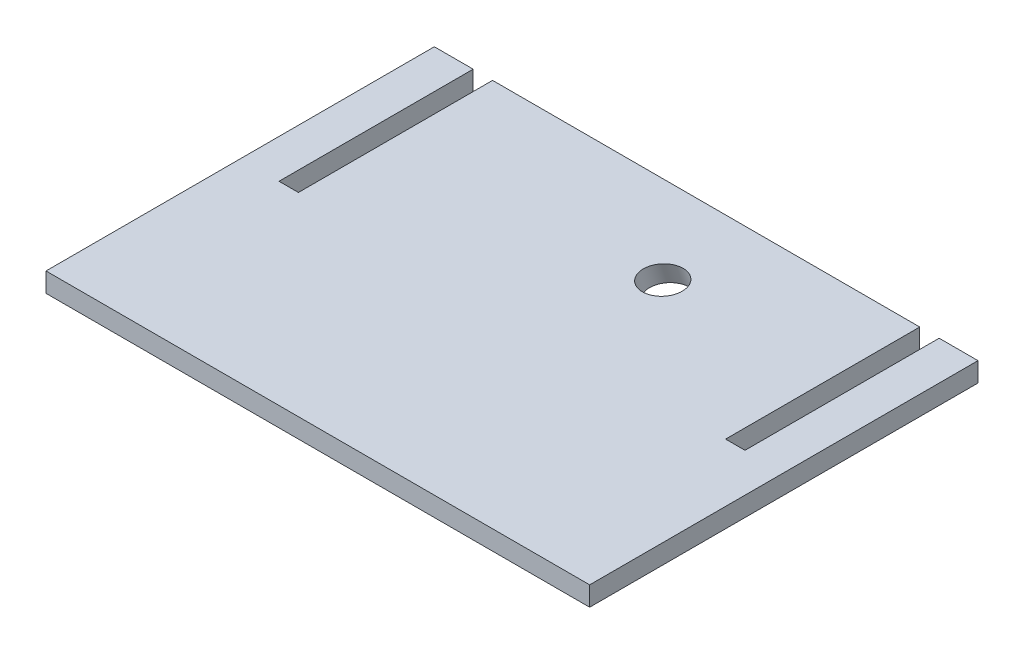
ISO-10303-21;
HEADER;
FILE_DESCRIPTION(('STEP AP214'),'2;1');
FILE_NAME('part.step','',(''),(''),'','','');
FILE_SCHEMA(('AUTOMOTIVE_DESIGN { 1 0 10303 214 1 1 1 1 }'));
ENDSEC;
DATA;
#1=APPLICATION_CONTEXT('core data for automotive mechanical design processes');
#2=APPLICATION_PROTOCOL_DEFINITION('international standard','automotive_design',2000,#1);
#3=PRODUCT_CONTEXT('',#1,'mechanical');
#4=PRODUCT('Part','Part','',(#3));
#5=PRODUCT_RELATED_PRODUCT_CATEGORY('part','',(#4));
#6=PRODUCT_DEFINITION_FORMATION('','',#4);
#7=PRODUCT_DEFINITION_CONTEXT('part definition',#1,'design');
#8=PRODUCT_DEFINITION('design','',#6,#7);
#9=PRODUCT_DEFINITION_SHAPE('','',#8);
#10=(LENGTH_UNIT() NAMED_UNIT(*) SI_UNIT(.MILLI.,.METRE.));
#11=(NAMED_UNIT(*) PLANE_ANGLE_UNIT() SI_UNIT($,.RADIAN.));
#12=(NAMED_UNIT(*) SI_UNIT($,.STERADIAN.) SOLID_ANGLE_UNIT());
#13=UNCERTAINTY_MEASURE_WITH_UNIT(LENGTH_MEASURE(1.E-05),#10,'distance_accuracy_value','');
#14=(GEOMETRIC_REPRESENTATION_CONTEXT(3) GLOBAL_UNCERTAINTY_ASSIGNED_CONTEXT((#13)) GLOBAL_UNIT_ASSIGNED_CONTEXT((#10,
#11,#12)) REPRESENTATION_CONTEXT('',''));
#15=CARTESIAN_POINT('',(0.,0.,0.));
#16=DIRECTION('',(0.,0.,1.));
#17=DIRECTION('',(1.,0.,0.));
#18=AXIS2_PLACEMENT_3D('',#15,#16,#17);
#19=CARTESIAN_POINT('',(-177.8,6.35,-127.));
#20=DIRECTION('',(0.,0.,1.));
#21=DIRECTION('',(1.,0.,0.));
#22=AXIS2_PLACEMENT_3D('',#19,#20,#21);
#23=PLANE('',#22);
#24=DIRECTION('',(-1.,0.,0.));
#25=VECTOR('',#24,1.);
#26=CARTESIAN_POINT('',(-177.8,6.35,-127.));
#27=LINE('',#26,#25);
#28=CARTESIAN_POINT('',(-152.4,6.35,-127.));
#29=VERTEX_POINT('',#28);
#30=CARTESIAN_POINT('',(-177.8,6.35,-127.));
#31=VERTEX_POINT('',#30);
#32=EDGE_CURVE('E223',#29,#31,#27,.T.);
#33=ORIENTED_EDGE('',*,*,#32,.F.);
#34=DIRECTION('',(0.,1.,0.));
#35=VECTOR('',#34,1.);
#36=CARTESIAN_POINT('',(-152.4,-6.35,-127.));
#37=LINE('',#36,#35);
#38=CARTESIAN_POINT('',(-152.4,-6.35,-127.));
#39=VERTEX_POINT('',#38);
#40=EDGE_CURVE('E201',#39,#29,#37,.T.);
#41=ORIENTED_EDGE('',*,*,#40,.F.);
#42=DIRECTION('',(-1.,0.,0.));
#43=VECTOR('',#42,1.);
#44=CARTESIAN_POINT('',(-177.8,-6.35,-127.));
#45=LINE('',#44,#43);
#46=CARTESIAN_POINT('',(-177.8,-6.35,-127.));
#47=VERTEX_POINT('',#46);
#48=EDGE_CURVE('E266',#39,#47,#45,.T.);
#49=ORIENTED_EDGE('',*,*,#48,.T.);
#50=DIRECTION('',(0.,-1.,0.));
#51=VECTOR('',#50,1.);
#52=CARTESIAN_POINT('',(-177.8,6.35,-127.));
#53=LINE('',#52,#51);
#54=EDGE_CURVE('E252',#31,#47,#53,.T.);
#55=ORIENTED_EDGE('',*,*,#54,.F.);
#56=EDGE_LOOP('',(#33,#41,#49,#55));
#57=FACE_BOUND('',#56,.T.);
#58=ADVANCED_FACE('F45',(#57),#23,.F.);
#59=CARTESIAN_POINT('',(139.7,-6.35,-127.));
#60=VERTEX_POINT('',#59);
#61=CARTESIAN_POINT('',(-139.7,-6.35,-127.));
#62=VERTEX_POINT('',#61);
#63=EDGE_CURVE('E200',#60,#62,#45,.T.);
#64=ORIENTED_EDGE('',*,*,#63,.T.);
#65=DIRECTION('',(0.,1.,0.));
#66=VECTOR('',#65,1.);
#67=CARTESIAN_POINT('',(-139.7,-6.35,-127.));
#68=LINE('',#67,#66);
#69=CARTESIAN_POINT('',(-139.7,6.35,-127.));
#70=VERTEX_POINT('',#69);
#71=EDGE_CURVE('E81',#62,#70,#68,.T.);
#72=ORIENTED_EDGE('',*,*,#71,.T.);
#73=CARTESIAN_POINT('',(139.7,6.35,-127.));
#74=VERTEX_POINT('',#73);
#75=EDGE_CURVE('E218',#74,#70,#27,.T.);
#76=ORIENTED_EDGE('',*,*,#75,.F.);
#77=DIRECTION('',(0.,1.,0.));
#78=VECTOR('',#77,1.);
#79=CARTESIAN_POINT('',(139.7,-6.35,-127.));
#80=LINE('',#79,#78);
#81=EDGE_CURVE('E176',#60,#74,#80,.T.);
#82=ORIENTED_EDGE('',*,*,#81,.F.);
#83=EDGE_LOOP('',(#64,#72,#76,#82));
#84=FACE_BOUND('',#83,.T.);
#85=ADVANCED_FACE('F304',(#84),#23,.F.);
#86=CARTESIAN_POINT('',(177.8,6.35,-127.));
#87=DIRECTION('',(-1.,0.,0.));
#88=DIRECTION('',(0.,0.,1.));
#89=AXIS2_PLACEMENT_3D('',#86,#87,#88);
#90=PLANE('',#89);
#91=DIRECTION('',(0.,0.,-1.));
#92=VECTOR('',#91,1.);
#93=CARTESIAN_POINT('',(177.8,-6.35,-127.));
#94=LINE('',#93,#92);
#95=CARTESIAN_POINT('',(177.8,-6.35,127.));
#96=VERTEX_POINT('',#95);
#97=CARTESIAN_POINT('',(177.8,-6.35,-127.));
#98=VERTEX_POINT('',#97);
#99=EDGE_CURVE('E199',#96,#98,#94,.T.);
#100=ORIENTED_EDGE('',*,*,#99,.T.);
#101=DIRECTION('',(0.,-1.,0.));
#102=VECTOR('',#101,1.);
#103=CARTESIAN_POINT('',(177.8,6.35,-127.));
#104=LINE('',#103,#102);
#105=CARTESIAN_POINT('',(177.8,6.35,-127.));
#106=VERTEX_POINT('',#105);
#107=EDGE_CURVE('E185',#106,#98,#104,.T.);
#108=ORIENTED_EDGE('',*,*,#107,.F.);
#109=DIRECTION('',(0.,0.,-1.));
#110=VECTOR('',#109,1.);
#111=CARTESIAN_POINT('',(177.8,6.35,-127.));
#112=LINE('',#111,#110);
#113=CARTESIAN_POINT('',(177.8,6.35,127.));
#114=VERTEX_POINT('',#113);
#115=EDGE_CURVE('E229',#114,#106,#112,.T.);
#116=ORIENTED_EDGE('',*,*,#115,.F.);
#117=DIRECTION('',(0.,-1.,0.));
#118=VECTOR('',#117,1.);
#119=CARTESIAN_POINT('',(177.8,6.35,127.));
#120=LINE('',#119,#118);
#121=EDGE_CURVE('E257',#114,#96,#120,.T.);
#122=ORIENTED_EDGE('',*,*,#121,.T.);
#123=EDGE_LOOP('',(#100,#108,#116,#122));
#124=FACE_BOUND('',#123,.T.);
#125=ADVANCED_FACE('F278',(#124),#90,.F.);
#126=CARTESIAN_POINT('',(152.4,-6.35,-127.));
#127=VERTEX_POINT('',#126);
#128=EDGE_CURVE('E186',#98,#127,#45,.T.);
#129=ORIENTED_EDGE('',*,*,#128,.T.);
#130=DIRECTION('',(0.,1.,0.));
#131=VECTOR('',#130,1.);
#132=CARTESIAN_POINT('',(152.4,-6.35,-127.));
#133=LINE('',#132,#131);
#134=CARTESIAN_POINT('',(152.4,6.35,-127.));
#135=VERTEX_POINT('',#134);
#136=EDGE_CURVE('E144',#127,#135,#133,.T.);
#137=ORIENTED_EDGE('',*,*,#136,.T.);
#138=EDGE_CURVE('E221',#106,#135,#27,.T.);
#139=ORIENTED_EDGE('',*,*,#138,.F.);
#140=ORIENTED_EDGE('',*,*,#107,.T.);
#141=EDGE_LOOP('',(#129,#137,#139,#140));
#142=FACE_BOUND('',#141,.T.);
#143=ADVANCED_FACE('F300',(#142),#23,.F.);
#144=CARTESIAN_POINT('',(-177.8,6.35,-127.));
#145=DIRECTION('',(1.,0.,0.));
#146=DIRECTION('',(0.,0.,-1.));
#147=AXIS2_PLACEMENT_3D('',#144,#145,#146);
#148=PLANE('',#147);
#149=DIRECTION('',(0.,0.,1.));
#150=VECTOR('',#149,1.);
#151=CARTESIAN_POINT('',(-177.8,-6.35,-127.));
#152=LINE('',#151,#150);
#153=CARTESIAN_POINT('',(-177.8,-6.35,127.));
#154=VERTEX_POINT('',#153);
#155=EDGE_CURVE('E261',#47,#154,#152,.T.);
#156=ORIENTED_EDGE('',*,*,#155,.T.);
#157=DIRECTION('',(0.,-1.,0.));
#158=VECTOR('',#157,1.);
#159=CARTESIAN_POINT('',(-177.8,6.35,127.));
#160=LINE('',#159,#158);
#161=CARTESIAN_POINT('',(-177.8,6.35,127.));
#162=VERTEX_POINT('',#161);
#163=EDGE_CURVE('E240',#162,#154,#160,.T.);
#164=ORIENTED_EDGE('',*,*,#163,.F.);
#165=DIRECTION('',(0.,0.,1.));
#166=VECTOR('',#165,1.);
#167=CARTESIAN_POINT('',(-177.8,6.35,-127.));
#168=LINE('',#167,#166);
#169=EDGE_CURVE('E232',#31,#162,#168,.T.);
#170=ORIENTED_EDGE('',*,*,#169,.F.);
#171=ORIENTED_EDGE('',*,*,#54,.T.);
#172=EDGE_LOOP('',(#156,#164,#170,#171));
#173=FACE_BOUND('',#172,.T.);
#174=ADVANCED_FACE('F292',(#173),#148,.F.);
#175=CARTESIAN_POINT('',(-177.8,6.35,127.));
#176=DIRECTION('',(0.,0.,-1.));
#177=DIRECTION('',(-1.,0.,0.));
#178=AXIS2_PLACEMENT_3D('',#175,#176,#177);
#179=PLANE('',#178);
#180=DIRECTION('',(1.,0.,0.));
#181=VECTOR('',#180,1.);
#182=CARTESIAN_POINT('',(-177.8,-6.35,127.));
#183=LINE('',#182,#181);
#184=EDGE_CURVE('E245',#154,#96,#183,.T.);
#185=ORIENTED_EDGE('',*,*,#184,.T.);
#186=ORIENTED_EDGE('',*,*,#121,.F.);
#187=DIRECTION('',(1.,0.,0.));
#188=VECTOR('',#187,1.);
#189=CARTESIAN_POINT('',(-177.8,6.35,127.));
#190=LINE('',#189,#188);
#191=EDGE_CURVE('E238',#162,#114,#190,.T.);
#192=ORIENTED_EDGE('',*,*,#191,.F.);
#193=ORIENTED_EDGE('',*,*,#163,.T.);
#194=EDGE_LOOP('',(#185,#186,#192,#193));
#195=FACE_BOUND('',#194,.T.);
#196=ADVANCED_FACE('F293',(#195),#179,.F.);
#197=CARTESIAN_POINT('',(0.,6.35,0.));
#198=DIRECTION('',(0.,1.,0.));
#199=DIRECTION('',(0.,0.,1.));
#200=AXIS2_PLACEMENT_3D('',#197,#198,#199);
#201=PLANE('',#200);
#202=CARTESIAN_POINT('',(29.06326332179,6.35,-69.5494140717771));
#203=DIRECTION('',(0.,1.,0.));
#204=DIRECTION('',(0.,0.,1.));
#205=AXIS2_PLACEMENT_3D('',#202,#203,#204);
#206=ELLIPSE('',#205,13.330179538405,12.7);
#207=CARTESIAN_POINT('',(29.0632633217901,6.35,-56.2192345333721));
#208=VERTEX_POINT('',#207);
#209=EDGE_CURVE('E49',#208,#208,#206,.F.);
#210=ORIENTED_EDGE('',*,*,#209,.T.);
#211=EDGE_LOOP('',(#210));
#212=FACE_BOUND('',#211,.T.);
#213=DIRECTION('',(0.,0.,1.));
#214=VECTOR('',#213,1.);
#215=CARTESIAN_POINT('',(-152.4,6.35,-127.));
#216=LINE('',#215,#214);
#217=CARTESIAN_POINT('',(-152.4,6.35,0.));
#218=VERTEX_POINT('',#217);
#219=EDGE_CURVE('E190',#29,#218,#216,.T.);
#220=ORIENTED_EDGE('',*,*,#219,.F.);
#221=ORIENTED_EDGE('',*,*,#32,.T.);
#222=ORIENTED_EDGE('',*,*,#169,.T.);
#223=ORIENTED_EDGE('',*,*,#191,.T.);
#224=ORIENTED_EDGE('',*,*,#115,.T.);
#225=ORIENTED_EDGE('',*,*,#138,.T.);
#226=DIRECTION('',(0.,0.,-1.));
#227=VECTOR('',#226,1.);
#228=CARTESIAN_POINT('',(152.4,6.35,-127.));
#229=LINE('',#228,#227);
#230=CARTESIAN_POINT('',(152.4,6.35,0.));
#231=VERTEX_POINT('',#230);
#232=EDGE_CURVE('E160',#231,#135,#229,.T.);
#233=ORIENTED_EDGE('',*,*,#232,.F.);
#234=DIRECTION('',(1.,0.,0.));
#235=VECTOR('',#234,1.);
#236=CARTESIAN_POINT('',(139.7,6.35,0.));
#237=LINE('',#236,#235);
#238=CARTESIAN_POINT('',(139.7,6.35,0.));
#239=VERTEX_POINT('',#238);
#240=EDGE_CURVE('E157',#239,#231,#237,.T.);
#241=ORIENTED_EDGE('',*,*,#240,.F.);
#242=DIRECTION('',(0.,0.,1.));
#243=VECTOR('',#242,1.);
#244=CARTESIAN_POINT('',(139.7,6.35,-127.));
#245=LINE('',#244,#243);
#246=EDGE_CURVE('E149',#74,#239,#245,.T.);
#247=ORIENTED_EDGE('',*,*,#246,.F.);
#248=ORIENTED_EDGE('',*,*,#75,.T.);
#249=DIRECTION('',(0.,0.,-1.));
#250=VECTOR('',#249,1.);
#251=CARTESIAN_POINT('',(-139.7,6.35,-127.));
#252=LINE('',#251,#250);
#253=CARTESIAN_POINT('',(-139.7,6.35,0.));
#254=VERTEX_POINT('',#253);
#255=EDGE_CURVE('E85',#254,#70,#252,.T.);
#256=ORIENTED_EDGE('',*,*,#255,.F.);
#257=DIRECTION('',(1.,0.,0.));
#258=VECTOR('',#257,1.);
#259=CARTESIAN_POINT('',(-152.4,6.35,0.));
#260=LINE('',#259,#258);
#261=EDGE_CURVE('E193',#218,#254,#260,.T.);
#262=ORIENTED_EDGE('',*,*,#261,.F.);
#263=EDGE_LOOP('',(#220,#221,#222,#223,#224,#225,#233,#241,#247,#248,#256,#262));
#264=FACE_BOUND('',#263,.T.);
#265=ADVANCED_FACE('F47',(#212,#264),#201,.T.);
#266=CARTESIAN_POINT('',(0.,-6.35,0.));
#267=DIRECTION('',(0.,1.,0.));
#268=DIRECTION('',(0.,0.,1.));
#269=AXIS2_PLACEMENT_3D('',#266,#267,#268);
#270=PLANE('',#269);
#271=CARTESIAN_POINT('',(29.06326332179,-6.35,-73.599560553833));
#272=DIRECTION('',(0.,1.,0.));
#273=DIRECTION('',(0.,0.,1.));
#274=AXIS2_PLACEMENT_3D('',#271,#272,#273);
#275=ELLIPSE('',#274,13.330179538405,12.7);
#276=CARTESIAN_POINT('',(29.0632633217901,-6.35,-60.2693810154281));
#277=VERTEX_POINT('',#276);
#278=EDGE_CURVE('E11',#277,#277,#275,.F.);
#279=ORIENTED_EDGE('',*,*,#278,.F.);
#280=EDGE_LOOP('',(#279));
#281=FACE_BOUND('',#280,.T.);
#282=ORIENTED_EDGE('',*,*,#48,.F.);
#283=DIRECTION('',(0.,0.,1.));
#284=VECTOR('',#283,1.);
#285=CARTESIAN_POINT('',(-152.4,-6.35,-127.));
#286=LINE('',#285,#284);
#287=CARTESIAN_POINT('',(-152.4,-6.35,0.));
#288=VERTEX_POINT('',#287);
#289=EDGE_CURVE('E215',#39,#288,#286,.T.);
#290=ORIENTED_EDGE('',*,*,#289,.T.);
#291=DIRECTION('',(1.,0.,0.));
#292=VECTOR('',#291,1.);
#293=CARTESIAN_POINT('',(-152.4,-6.35,0.));
#294=LINE('',#293,#292);
#295=CARTESIAN_POINT('',(-139.7,-6.35,0.));
#296=VERTEX_POINT('',#295);
#297=EDGE_CURVE('E212',#288,#296,#294,.T.);
#298=ORIENTED_EDGE('',*,*,#297,.T.);
#299=DIRECTION('',(0.,0.,-1.));
#300=VECTOR('',#299,1.);
#301=CARTESIAN_POINT('',(-139.7,-6.35,-127.));
#302=LINE('',#301,#300);
#303=EDGE_CURVE('E169',#296,#62,#302,.T.);
#304=ORIENTED_EDGE('',*,*,#303,.T.);
#305=ORIENTED_EDGE('',*,*,#63,.F.);
#306=DIRECTION('',(0.,0.,1.));
#307=VECTOR('',#306,1.);
#308=CARTESIAN_POINT('',(139.7,-6.35,-127.));
#309=LINE('',#308,#307);
#310=CARTESIAN_POINT('',(139.7,-6.35,0.));
#311=VERTEX_POINT('',#310);
#312=EDGE_CURVE('E165',#60,#311,#309,.T.);
#313=ORIENTED_EDGE('',*,*,#312,.T.);
#314=DIRECTION('',(1.,0.,0.));
#315=VECTOR('',#314,1.);
#316=CARTESIAN_POINT('',(139.7,-6.35,0.));
#317=LINE('',#316,#315);
#318=CARTESIAN_POINT('',(152.4,-6.35,0.));
#319=VERTEX_POINT('',#318);
#320=EDGE_CURVE('E150',#311,#319,#317,.T.);
#321=ORIENTED_EDGE('',*,*,#320,.T.);
#322=DIRECTION('',(0.,0.,-1.));
#323=VECTOR('',#322,1.);
#324=CARTESIAN_POINT('',(152.4,-6.35,-127.));
#325=LINE('',#324,#323);
#326=EDGE_CURVE('E138',#319,#127,#325,.T.);
#327=ORIENTED_EDGE('',*,*,#326,.T.);
#328=ORIENTED_EDGE('',*,*,#128,.F.);
#329=ORIENTED_EDGE('',*,*,#99,.F.);
#330=ORIENTED_EDGE('',*,*,#184,.F.);
#331=ORIENTED_EDGE('',*,*,#155,.F.);
#332=EDGE_LOOP('',(#282,#290,#298,#304,#305,#313,#321,#327,#328,#329,#330,#331));
#333=FACE_BOUND('',#332,.T.);
#334=ADVANCED_FACE('F163',(#281,#333),#270,.F.);
#335=CARTESIAN_POINT('',(139.7,-6.35,-127.));
#336=DIRECTION('',(-1.,0.,0.));
#337=DIRECTION('',(0.,0.,1.));
#338=AXIS2_PLACEMENT_3D('',#335,#336,#337);
#339=PLANE('',#338);
#340=ORIENTED_EDGE('',*,*,#246,.T.);
#341=DIRECTION('',(0.,1.,0.));
#342=VECTOR('',#341,1.);
#343=CARTESIAN_POINT('',(139.7,-6.35,0.));
#344=LINE('',#343,#342);
#345=EDGE_CURVE('E179',#311,#239,#344,.T.);
#346=ORIENTED_EDGE('',*,*,#345,.F.);
#347=ORIENTED_EDGE('',*,*,#312,.F.);
#348=ORIENTED_EDGE('',*,*,#81,.T.);
#349=EDGE_LOOP('',(#340,#346,#347,#348));
#350=FACE_BOUND('',#349,.T.);
#351=ADVANCED_FACE('F370',(#350),#339,.F.);
#352=CARTESIAN_POINT('',(152.4,-6.35,-127.));
#353=DIRECTION('',(1.,0.,0.));
#354=DIRECTION('',(0.,0.,-1.));
#355=AXIS2_PLACEMENT_3D('',#352,#353,#354);
#356=PLANE('',#355);
#357=ORIENTED_EDGE('',*,*,#232,.T.);
#358=ORIENTED_EDGE('',*,*,#136,.F.);
#359=ORIENTED_EDGE('',*,*,#326,.F.);
#360=DIRECTION('',(0.,1.,0.));
#361=VECTOR('',#360,1.);
#362=CARTESIAN_POINT('',(152.4,-6.35,0.));
#363=LINE('',#362,#361);
#364=EDGE_CURVE('E141',#319,#231,#363,.T.);
#365=ORIENTED_EDGE('',*,*,#364,.T.);
#366=EDGE_LOOP('',(#357,#358,#359,#365));
#367=FACE_BOUND('',#366,.T.);
#368=ADVANCED_FACE('F140',(#367),#356,.F.);
#369=CARTESIAN_POINT('',(139.7,-6.35,0.));
#370=DIRECTION('',(0.,0.,1.));
#371=DIRECTION('',(1.,0.,0.));
#372=AXIS2_PLACEMENT_3D('',#369,#370,#371);
#373=PLANE('',#372);
#374=ORIENTED_EDGE('',*,*,#240,.T.);
#375=ORIENTED_EDGE('',*,*,#364,.F.);
#376=ORIENTED_EDGE('',*,*,#320,.F.);
#377=ORIENTED_EDGE('',*,*,#345,.T.);
#378=EDGE_LOOP('',(#374,#375,#376,#377));
#379=FACE_BOUND('',#378,.T.);
#380=ADVANCED_FACE('F154',(#379),#373,.F.);
#381=CARTESIAN_POINT('',(-152.4,-6.35,-127.));
#382=DIRECTION('',(-1.,0.,0.));
#383=DIRECTION('',(0.,0.,1.));
#384=AXIS2_PLACEMENT_3D('',#381,#382,#383);
#385=PLANE('',#384);
#386=ORIENTED_EDGE('',*,*,#219,.T.);
#387=DIRECTION('',(0.,1.,0.));
#388=VECTOR('',#387,1.);
#389=CARTESIAN_POINT('',(-152.4,-6.35,0.));
#390=LINE('',#389,#388);
#391=EDGE_CURVE('E56',#288,#218,#390,.T.);
#392=ORIENTED_EDGE('',*,*,#391,.F.);
#393=ORIENTED_EDGE('',*,*,#289,.F.);
#394=ORIENTED_EDGE('',*,*,#40,.T.);
#395=EDGE_LOOP('',(#386,#392,#393,#394));
#396=FACE_BOUND('',#395,.T.);
#397=ADVANCED_FACE('F398',(#396),#385,.F.);
#398=CARTESIAN_POINT('',(-139.7,-6.35,-127.));
#399=DIRECTION('',(1.,0.,0.));
#400=DIRECTION('',(0.,0.,-1.));
#401=AXIS2_PLACEMENT_3D('',#398,#399,#400);
#402=PLANE('',#401);
#403=ORIENTED_EDGE('',*,*,#255,.T.);
#404=ORIENTED_EDGE('',*,*,#71,.F.);
#405=ORIENTED_EDGE('',*,*,#303,.F.);
#406=DIRECTION('',(0.,1.,0.));
#407=VECTOR('',#406,1.);
#408=CARTESIAN_POINT('',(-139.7,-6.35,0.));
#409=LINE('',#408,#407);
#410=EDGE_CURVE('E194',#296,#254,#409,.T.);
#411=ORIENTED_EDGE('',*,*,#410,.T.);
#412=EDGE_LOOP('',(#403,#404,#405,#411));
#413=FACE_BOUND('',#412,.T.);
#414=ADVANCED_FACE('F408',(#413),#402,.F.);
#415=CARTESIAN_POINT('',(-152.4,-6.35,0.));
#416=DIRECTION('',(0.,0.,1.));
#417=DIRECTION('',(1.,0.,0.));
#418=AXIS2_PLACEMENT_3D('',#415,#416,#417);
#419=PLANE('',#418);
#420=ORIENTED_EDGE('',*,*,#261,.T.);
#421=ORIENTED_EDGE('',*,*,#410,.F.);
#422=ORIENTED_EDGE('',*,*,#297,.F.);
#423=ORIENTED_EDGE('',*,*,#391,.T.);
#424=EDGE_LOOP('',(#420,#421,#422,#423));
#425=FACE_BOUND('',#424,.T.);
#426=ADVANCED_FACE('F419',(#425),#419,.F.);
#427=CARTESIAN_POINT('',(29.0632633217899,-44.4499999999978,-85.7500000000002));
#428=DIRECTION('',(0.,0.95272535252887,0.303832853142546));
#429=DIRECTION('',(0.,-0.303832853142546,0.95272535252887));
#430=AXIS2_PLACEMENT_3D('',#427,#428,#429);
#431=CYLINDRICAL_SURFACE('',#430,12.7);
#432=ORIENTED_EDGE('',*,*,#209,.F.);
#433=EDGE_LOOP('',(#432));
#434=FACE_BOUND('',#433,.T.);
#435=ORIENTED_EDGE('',*,*,#278,.T.);
#436=EDGE_LOOP('',(#435));
#437=FACE_BOUND('',#436,.T.);
#438=ADVANCED_FACE('F429',(#434,#437),#431,.F.);
#439=CLOSED_SHELL('',(#58,#85,#125,#143,#174,#196,#265,#334,#351,#368,#380,#397,#414,#426,#438));
#440=MANIFOLD_SOLID_BREP('B2',#439);
#441=ADVANCED_BREP_SHAPE_REPRESENTATION('',(#18,#440),#14);
#442=SHAPE_DEFINITION_REPRESENTATION(#9,#441);
ENDSEC;
END-ISO-10303-21;
